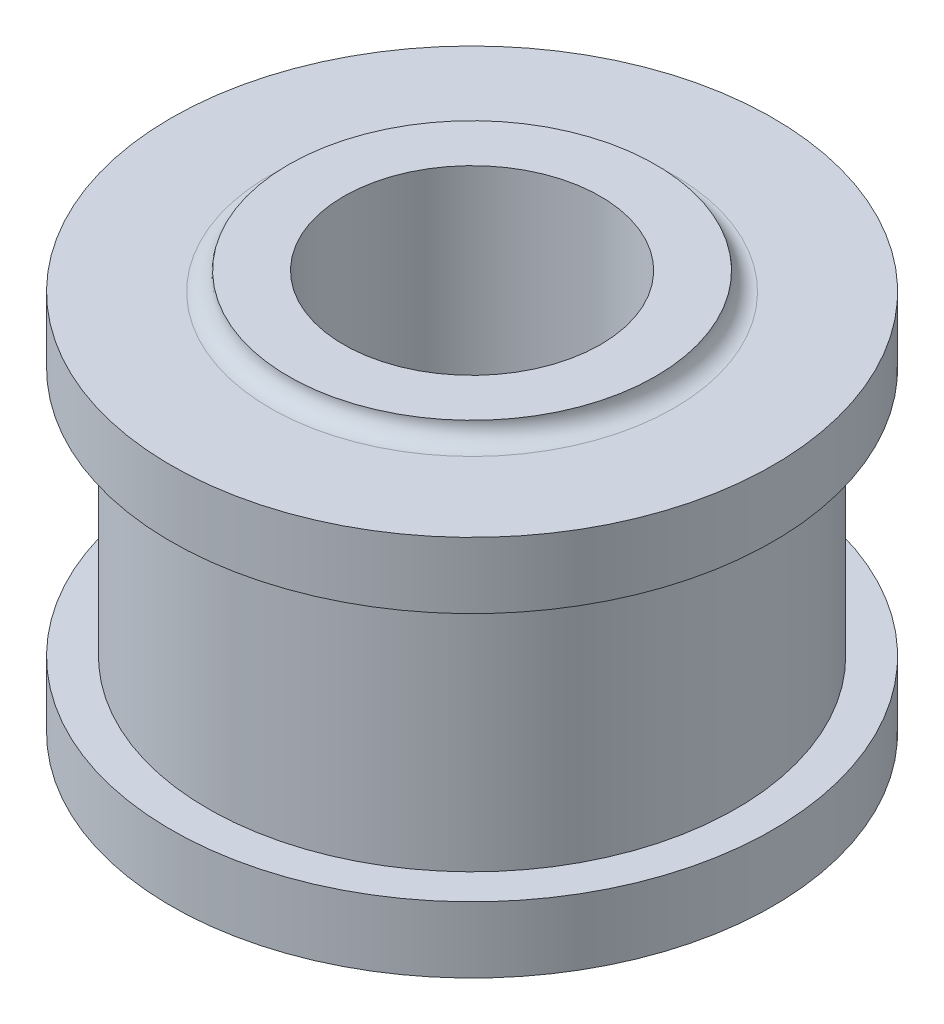
ISO-10303-21;
HEADER;
FILE_DESCRIPTION(('STEP AP214'),'2;1');
FILE_NAME('part.step','',(''),(''),'','','');
FILE_SCHEMA(('AUTOMOTIVE_DESIGN { 1 0 10303 214 1 1 1 1 }'));
ENDSEC;
DATA;
#1=APPLICATION_CONTEXT('core data for automotive mechanical design processes');
#2=APPLICATION_PROTOCOL_DEFINITION('international standard','automotive_design',2000,#1);
#3=PRODUCT_CONTEXT('',#1,'mechanical');
#4=PRODUCT('Part','Part','',(#3));
#5=PRODUCT_RELATED_PRODUCT_CATEGORY('part','',(#4));
#6=PRODUCT_DEFINITION_FORMATION('','',#4);
#7=PRODUCT_DEFINITION_CONTEXT('part definition',#1,'design');
#8=PRODUCT_DEFINITION('design','',#6,#7);
#9=PRODUCT_DEFINITION_SHAPE('','',#8);
#10=(LENGTH_UNIT() NAMED_UNIT(*) SI_UNIT(.MILLI.,.METRE.));
#11=(NAMED_UNIT(*) PLANE_ANGLE_UNIT() SI_UNIT($,.RADIAN.));
#12=(NAMED_UNIT(*) SI_UNIT($,.STERADIAN.) SOLID_ANGLE_UNIT());
#13=UNCERTAINTY_MEASURE_WITH_UNIT(LENGTH_MEASURE(1.E-05),#10,'distance_accuracy_value','');
#14=(GEOMETRIC_REPRESENTATION_CONTEXT(3) GLOBAL_UNCERTAINTY_ASSIGNED_CONTEXT((#13)) GLOBAL_UNIT_ASSIGNED_CONTEXT((#10,
#11,#12)) REPRESENTATION_CONTEXT('',''));
#15=CARTESIAN_POINT('',(0.,0.,0.));
#16=DIRECTION('',(0.,0.,1.));
#17=DIRECTION('',(1.,0.,0.));
#18=AXIS2_PLACEMENT_3D('',#15,#16,#17);
#19=CARTESIAN_POINT('',(0.,0.,0.));
#20=DIRECTION('',(0.,1.,0.));
#21=DIRECTION('',(-1.,0.,0.));
#22=AXIS2_PLACEMENT_3D('',#19,#20,#21);
#23=PLANE('',#22);
#24=CARTESIAN_POINT('',(0.,0.,0.));
#25=DIRECTION('',(0.,1.,0.));
#26=DIRECTION('',(-1.,0.,0.));
#27=AXIS2_PLACEMENT_3D('',#24,#25,#26);
#28=CIRCLE('',#27,17.5);
#29=CARTESIAN_POINT('',(-17.5,0.,0.));
#30=VERTEX_POINT('',#29);
#31=EDGE_CURVE('E71',#30,#30,#28,.F.);
#32=ORIENTED_EDGE('',*,*,#31,.F.);
#33=EDGE_LOOP('',(#32));
#34=FACE_BOUND('',#33,.T.);
#35=CARTESIAN_POINT('',(0.,0.,0.));
#36=DIRECTION('',(0.,1.,0.));
#37=DIRECTION('',(-1.,0.,0.));
#38=AXIS2_PLACEMENT_3D('',#35,#36,#37);
#39=CIRCLE('',#38,25.);
#40=CARTESIAN_POINT('',(-25.,0.,0.));
#41=VERTEX_POINT('',#40);
#42=EDGE_CURVE('E44',#41,#41,#39,.T.);
#43=ORIENTED_EDGE('',*,*,#42,.F.);
#44=EDGE_LOOP('',(#43));
#45=FACE_BOUND('',#44,.T.);
#46=ADVANCED_FACE('F33',(#34,#45),#23,.F.);
#47=CARTESIAN_POINT('',(25.,2.49999999999998,0.));
#48=DIRECTION('',(0.,1.,0.));
#49=DIRECTION('',(-1.,0.,0.));
#50=AXIS2_PLACEMENT_3D('',#47,#48,#49);
#51=PLANE('',#50);
#52=CARTESIAN_POINT('',(0.,2.49999999999998,0.));
#53=DIRECTION('',(0.,1.,0.));
#54=DIRECTION('',(-1.,0.,0.));
#55=AXIS2_PLACEMENT_3D('',#52,#53,#54);
#56=CIRCLE('',#55,27.5);
#57=CARTESIAN_POINT('',(-27.5,2.49999999999997,0.));
#58=VERTEX_POINT('',#57);
#59=EDGE_CURVE('E40',#58,#58,#56,.T.);
#60=ORIENTED_EDGE('',*,*,#59,.T.);
#61=EDGE_LOOP('',(#60));
#62=FACE_BOUND('',#61,.T.);
#63=CARTESIAN_POINT('',(0.,2.49999999999998,0.));
#64=DIRECTION('',(0.,1.,0.));
#65=DIRECTION('',(-1.,0.,0.));
#66=AXIS2_PLACEMENT_3D('',#63,#64,#65);
#67=CIRCLE('',#66,41.);
#68=CARTESIAN_POINT('',(-41.,2.49999999999997,0.));
#69=VERTEX_POINT('',#68);
#70=EDGE_CURVE('E48',#69,#69,#67,.T.);
#71=ORIENTED_EDGE('',*,*,#70,.F.);
#72=EDGE_LOOP('',(#71));
#73=FACE_BOUND('',#72,.T.);
#74=ADVANCED_FACE('F96',(#62,#73),#51,.F.);
#75=CARTESIAN_POINT('',(0.,60.7377049180328,0.));
#76=DIRECTION('',(0.,1.,0.));
#77=DIRECTION('',(-1.,0.,0.));
#78=AXIS2_PLACEMENT_3D('',#75,#76,#77);
#79=CYLINDRICAL_SURFACE('',#78,41.);
#80=CARTESIAN_POINT('',(0.,11.5,0.));
#81=DIRECTION('',(0.,1.,0.));
#82=DIRECTION('',(-1.,0.,0.));
#83=AXIS2_PLACEMENT_3D('',#80,#81,#82);
#84=CIRCLE('',#83,41.);
#85=CARTESIAN_POINT('',(-41.,11.5,0.));
#86=VERTEX_POINT('',#85);
#87=EDGE_CURVE('E53',#86,#86,#84,.T.);
#88=ORIENTED_EDGE('',*,*,#87,.F.);
#89=EDGE_LOOP('',(#88));
#90=FACE_BOUND('',#89,.T.);
#91=ORIENTED_EDGE('',*,*,#70,.T.);
#92=EDGE_LOOP('',(#91));
#93=FACE_BOUND('',#92,.T.);
#94=ADVANCED_FACE('F102',(#90,#93),#79,.T.);
#95=CARTESIAN_POINT('',(41.,11.5,0.));
#96=DIRECTION('',(0.,-1.,0.));
#97=DIRECTION('',(1.,0.,0.));
#98=AXIS2_PLACEMENT_3D('',#95,#96,#97);
#99=PLANE('',#98);
#100=CARTESIAN_POINT('',(0.,11.5,0.));
#101=DIRECTION('',(0.,1.,0.));
#102=DIRECTION('',(-1.,0.,0.));
#103=AXIS2_PLACEMENT_3D('',#100,#101,#102);
#104=CIRCLE('',#103,36.);
#105=CARTESIAN_POINT('',(-36.,11.5,0.));
#106=VERTEX_POINT('',#105);
#107=EDGE_CURVE('E56',#106,#106,#104,.T.);
#108=ORIENTED_EDGE('',*,*,#107,.F.);
#109=EDGE_LOOP('',(#108));
#110=FACE_BOUND('',#109,.T.);
#111=ORIENTED_EDGE('',*,*,#87,.T.);
#112=EDGE_LOOP('',(#111));
#113=FACE_BOUND('',#112,.T.);
#114=ADVANCED_FACE('F109',(#110,#113),#99,.F.);
#115=CARTESIAN_POINT('',(0.,60.7377049180328,0.));
#116=DIRECTION('',(0.,1.,0.));
#117=DIRECTION('',(-1.,0.,0.));
#118=AXIS2_PLACEMENT_3D('',#115,#116,#117);
#119=CYLINDRICAL_SURFACE('',#118,36.);
#120=CARTESIAN_POINT('',(0.,45.5,0.));
#121=DIRECTION('',(0.,1.,0.));
#122=DIRECTION('',(-1.,0.,0.));
#123=AXIS2_PLACEMENT_3D('',#120,#121,#122);
#124=CIRCLE('',#123,36.);
#125=CARTESIAN_POINT('',(-36.,45.5,0.));
#126=VERTEX_POINT('',#125);
#127=EDGE_CURVE('E59',#126,#126,#124,.T.);
#128=ORIENTED_EDGE('',*,*,#127,.F.);
#129=EDGE_LOOP('',(#128));
#130=FACE_BOUND('',#129,.T.);
#131=ORIENTED_EDGE('',*,*,#107,.T.);
#132=EDGE_LOOP('',(#131));
#133=FACE_BOUND('',#132,.T.);
#134=ADVANCED_FACE('F113',(#130,#133),#119,.T.);
#135=CARTESIAN_POINT('',(36.,45.5,0.));
#136=DIRECTION('',(0.,1.,0.));
#137=DIRECTION('',(-1.,0.,0.));
#138=AXIS2_PLACEMENT_3D('',#135,#136,#137);
#139=PLANE('',#138);
#140=CARTESIAN_POINT('',(0.,45.5,0.));
#141=DIRECTION('',(0.,1.,0.));
#142=DIRECTION('',(-1.,0.,0.));
#143=AXIS2_PLACEMENT_3D('',#140,#141,#142);
#144=CIRCLE('',#143,41.);
#145=CARTESIAN_POINT('',(-41.,45.5,0.));
#146=VERTEX_POINT('',#145);
#147=EDGE_CURVE('E62',#146,#146,#144,.T.);
#148=ORIENTED_EDGE('',*,*,#147,.F.);
#149=EDGE_LOOP('',(#148));
#150=FACE_BOUND('',#149,.T.);
#151=ORIENTED_EDGE('',*,*,#127,.T.);
#152=EDGE_LOOP('',(#151));
#153=FACE_BOUND('',#152,.T.);
#154=ADVANCED_FACE('F117',(#150,#153),#139,.F.);
#155=CARTESIAN_POINT('',(0.,60.7377049180328,0.));
#156=DIRECTION('',(0.,1.,0.));
#157=DIRECTION('',(-1.,0.,0.));
#158=AXIS2_PLACEMENT_3D('',#155,#156,#157);
#159=CYLINDRICAL_SURFACE('',#158,41.);
#160=CARTESIAN_POINT('',(0.,54.5,0.));
#161=DIRECTION('',(0.,1.,0.));
#162=DIRECTION('',(-1.,0.,0.));
#163=AXIS2_PLACEMENT_3D('',#160,#161,#162);
#164=CIRCLE('',#163,41.);
#165=CARTESIAN_POINT('',(-41.,54.5,0.));
#166=VERTEX_POINT('',#165);
#167=EDGE_CURVE('E65',#166,#166,#164,.T.);
#168=ORIENTED_EDGE('',*,*,#167,.F.);
#169=EDGE_LOOP('',(#168));
#170=FACE_BOUND('',#169,.T.);
#171=ORIENTED_EDGE('',*,*,#147,.T.);
#172=EDGE_LOOP('',(#171));
#173=FACE_BOUND('',#172,.T.);
#174=ADVANCED_FACE('F121',(#170,#173),#159,.T.);
#175=CARTESIAN_POINT('',(41.,54.5,0.));
#176=DIRECTION('',(0.,-1.,0.));
#177=DIRECTION('',(1.,0.,0.));
#178=AXIS2_PLACEMENT_3D('',#175,#176,#177);
#179=PLANE('',#178);
#180=CARTESIAN_POINT('',(0.,54.5,0.));
#181=DIRECTION('',(0.,-1.,0.));
#182=DIRECTION('',(1.,0.,0.));
#183=AXIS2_PLACEMENT_3D('',#180,#181,#182);
#184=CIRCLE('',#183,27.5);
#185=CARTESIAN_POINT('',(27.5,54.5,0.));
#186=VERTEX_POINT('',#185);
#187=EDGE_CURVE('E10',#186,#186,#184,.T.);
#188=ORIENTED_EDGE('',*,*,#187,.T.);
#189=EDGE_LOOP('',(#188));
#190=FACE_BOUND('',#189,.T.);
#191=ORIENTED_EDGE('',*,*,#167,.T.);
#192=EDGE_LOOP('',(#191));
#193=FACE_BOUND('',#192,.T.);
#194=ADVANCED_FACE('F84',(#190,#193),#179,.F.);
#195=CARTESIAN_POINT('',(25.,57.,0.));
#196=DIRECTION('',(0.,-1.,0.));
#197=DIRECTION('',(1.,0.,0.));
#198=AXIS2_PLACEMENT_3D('',#195,#196,#197);
#199=PLANE('',#198);
#200=CARTESIAN_POINT('',(0.,57.,0.));
#201=DIRECTION('',(0.,1.,0.));
#202=DIRECTION('',(-1.,0.,0.));
#203=AXIS2_PLACEMENT_3D('',#200,#201,#202);
#204=CIRCLE('',#203,17.5);
#205=CARTESIAN_POINT('',(-17.5,57.,0.));
#206=VERTEX_POINT('',#205);
#207=EDGE_CURVE('E74',#206,#206,#204,.T.);
#208=ORIENTED_EDGE('',*,*,#207,.F.);
#209=EDGE_LOOP('',(#208));
#210=FACE_BOUND('',#209,.T.);
#211=CARTESIAN_POINT('',(0.,57.,0.));
#212=DIRECTION('',(0.,1.,0.));
#213=DIRECTION('',(-1.,0.,0.));
#214=AXIS2_PLACEMENT_3D('',#211,#212,#213);
#215=CIRCLE('',#214,25.);
#216=CARTESIAN_POINT('',(-25.,57.,0.));
#217=VERTEX_POINT('',#216);
#218=EDGE_CURVE('E68',#217,#217,#215,.T.);
#219=ORIENTED_EDGE('',*,*,#218,.T.);
#220=EDGE_LOOP('',(#219));
#221=FACE_BOUND('',#220,.T.);
#222=ADVANCED_FACE('F81',(#210,#221),#199,.F.);
#223=CARTESIAN_POINT('',(0.,-0.00100000000002876,0.));
#224=DIRECTION('',(0.,1.,0.));
#225=DIRECTION('',(-1.,0.,0.));
#226=AXIS2_PLACEMENT_3D('',#223,#224,#225);
#227=CYLINDRICAL_SURFACE('',#226,17.5);
#228=CARTESIAN_POINT('',(-17.5,57.,0.));
#229=CARTESIAN_POINT('',(-17.5,56.40625,0.));
#230=CARTESIAN_POINT('',(-17.5,55.8125,0.));
#231=CARTESIAN_POINT('',(-17.5,54.625,0.));
#232=CARTESIAN_POINT('',(-17.5,54.03125,0.));
#233=CARTESIAN_POINT('',(-17.5,52.84375,0.));
#234=CARTESIAN_POINT('',(-17.5,52.25,0.));
#235=CARTESIAN_POINT('',(-17.5,51.0625,0.));
#236=CARTESIAN_POINT('',(-17.5,50.46875,0.));
#237=CARTESIAN_POINT('',(-17.5,49.28125,0.));
#238=CARTESIAN_POINT('',(-17.5,48.6875,0.));
#239=CARTESIAN_POINT('',(-17.5,47.5,0.));
#240=CARTESIAN_POINT('',(-17.5,46.90625,0.));
#241=CARTESIAN_POINT('',(-17.5,45.71875,0.));
#242=CARTESIAN_POINT('',(-17.5,45.125,0.));
#243=CARTESIAN_POINT('',(-17.5,43.9375,0.));
#244=CARTESIAN_POINT('',(-17.5,43.34375,0.));
#245=CARTESIAN_POINT('',(-17.5,42.15625,0.));
#246=CARTESIAN_POINT('',(-17.5,41.5625,0.));
#247=CARTESIAN_POINT('',(-17.5,40.375,0.));
#248=CARTESIAN_POINT('',(-17.5,39.78125,0.));
#249=CARTESIAN_POINT('',(-17.5,38.59375,0.));
#250=CARTESIAN_POINT('',(-17.5,38.,0.));
#251=CARTESIAN_POINT('',(-17.5,36.8125,0.));
#252=CARTESIAN_POINT('',(-17.5,36.21875,0.));
#253=CARTESIAN_POINT('',(-17.5,35.03125,0.));
#254=CARTESIAN_POINT('',(-17.5,34.4375,0.));
#255=CARTESIAN_POINT('',(-17.5,33.25,0.));
#256=CARTESIAN_POINT('',(-17.5,32.65625,0.));
#257=CARTESIAN_POINT('',(-17.5,31.46875,0.));
#258=CARTESIAN_POINT('',(-17.5,30.875,0.));
#259=CARTESIAN_POINT('',(-17.5,29.6875,0.));
#260=CARTESIAN_POINT('',(-17.5,29.09375,0.));
#261=CARTESIAN_POINT('',(-17.5,27.90625,0.));
#262=CARTESIAN_POINT('',(-17.5,27.3125,0.));
#263=CARTESIAN_POINT('',(-17.5,26.125,0.));
#264=CARTESIAN_POINT('',(-17.5,25.53125,0.));
#265=CARTESIAN_POINT('',(-17.5,24.34375,0.));
#266=CARTESIAN_POINT('',(-17.5,23.75,0.));
#267=CARTESIAN_POINT('',(-17.5,22.5625,0.));
#268=CARTESIAN_POINT('',(-17.5,21.96875,0.));
#269=CARTESIAN_POINT('',(-17.5,20.78125,0.));
#270=CARTESIAN_POINT('',(-17.5,20.1875,0.));
#271=CARTESIAN_POINT('',(-17.5,19.,0.));
#272=CARTESIAN_POINT('',(-17.5,18.40625,0.));
#273=CARTESIAN_POINT('',(-17.5,17.21875,0.));
#274=CARTESIAN_POINT('',(-17.5,16.625,0.));
#275=CARTESIAN_POINT('',(-17.5,15.4375,0.));
#276=CARTESIAN_POINT('',(-17.5,14.84375,0.));
#277=CARTESIAN_POINT('',(-17.5,13.65625,0.));
#278=CARTESIAN_POINT('',(-17.5,13.0625,0.));
#279=CARTESIAN_POINT('',(-17.5,11.875,0.));
#280=CARTESIAN_POINT('',(-17.5,11.28125,0.));
#281=CARTESIAN_POINT('',(-17.5,10.09375,0.));
#282=CARTESIAN_POINT('',(-17.5,9.5,0.));
#283=CARTESIAN_POINT('',(-17.5,8.3125,0.));
#284=CARTESIAN_POINT('',(-17.5,7.71875,0.));
#285=CARTESIAN_POINT('',(-17.5,6.53125,0.));
#286=CARTESIAN_POINT('',(-17.5,5.9375,0.));
#287=CARTESIAN_POINT('',(-17.5,4.75,0.));
#288=CARTESIAN_POINT('',(-17.5,4.15625,0.));
#289=CARTESIAN_POINT('',(-17.5,2.96875,0.));
#290=CARTESIAN_POINT('',(-17.5,2.375,0.));
#291=CARTESIAN_POINT('',(-17.5,1.1875,0.));
#292=CARTESIAN_POINT('',(-17.5,0.593750000000002,0.));
#293=CARTESIAN_POINT('',(-17.5,0.,0.));
#294=B_SPLINE_CURVE_WITH_KNOTS('',3,(#228,#229,#230,#231,#232,#233,#234,#235,#236,#237,#238,
#239,#240,#241,#242,#243,#244,#245,#246,#247,#248,#249,#250,#251,#252,#253,#254,#255,#256,#257,
#258,#259,#260,#261,#262,#263,#264,#265,#266,#267,#268,#269,#270,#271,#272,#273,#274,#275,#276,
#277,#278,#279,#280,#281,#282,#283,#284,#285,#286,#287,#288,#289,#290,#291,#292,#293),
.UNSPECIFIED.,.F.,.F.,(4,2,2,2,2,2,2,2,2,2,2,2,2,2,2,2,2,2,2,2,2,2,2,2,2,2,2,2,2,2,2,2,4),(0.,
1.78125,3.5625,5.34375,7.125,8.90625,10.6875,12.46875,14.25,16.03125,17.8125,19.59375,21.375,
23.15625,24.9375,26.71875,28.5,30.28125,32.0625,33.84375,35.625,37.40625,39.1875,40.96875,42.75,
44.53125,46.3125,48.09375,49.875,51.65625,53.4375,55.21875,57.),.UNSPECIFIED.);
#295=EDGE_CURVE('BSEAM78',#206,#30,#294,.T.);
#296=ORIENTED_EDGE('',*,*,#207,.T.);
#297=ORIENTED_EDGE('',*,*,#31,.T.);
#298=ORIENTED_EDGE('',*,*,#295,.T.);
#299=ORIENTED_EDGE('',*,*,#295,.F.);
#300=EDGE_LOOP('',(#296,#298,#297,#299));
#301=FACE_BOUND('',#300,.T.);
#302=ADVANCED_FACE('F78',(#301),#227,.F.);
#303=CARTESIAN_POINT('',(0.,0.,0.));
#304=DIRECTION('',(0.,1.,0.));
#305=DIRECTION('',(-1.,0.,0.));
#306=AXIS2_PLACEMENT_3D('',#303,#304,#305);
#307=TOROIDAL_SURFACE('',#306,27.5,2.5);
#308=ORIENTED_EDGE('',*,*,#42,.T.);
#309=EDGE_LOOP('',(#308));
#310=FACE_BOUND('',#309,.T.);
#311=ORIENTED_EDGE('',*,*,#59,.F.);
#312=EDGE_LOOP('',(#311));
#313=FACE_BOUND('',#312,.T.);
#314=ADVANCED_FACE('F89',(#310,#313),#307,.F.);
#315=CARTESIAN_POINT('',(0.,57.,0.));
#316=DIRECTION('',(0.,-1.,0.));
#317=DIRECTION('',(1.,0.,0.));
#318=AXIS2_PLACEMENT_3D('',#315,#316,#317);
#319=TOROIDAL_SURFACE('',#318,27.5,2.5);
#320=ORIENTED_EDGE('',*,*,#187,.F.);
#321=EDGE_LOOP('',(#320));
#322=FACE_BOUND('',#321,.T.);
#323=ORIENTED_EDGE('',*,*,#218,.F.);
#324=EDGE_LOOP('',(#323));
#325=FACE_BOUND('',#324,.T.);
#326=ADVANCED_FACE('F35',(#322,#325),#319,.F.);
#327=CLOSED_SHELL('',(#46,#74,#94,#114,#134,#154,#174,#194,#222,#302,#314,#326));
#328=MANIFOLD_SOLID_BREP('B2',#327);
#329=ADVANCED_BREP_SHAPE_REPRESENTATION('',(#18,#328),#14);
#330=SHAPE_DEFINITION_REPRESENTATION(#9,#329);
ENDSEC;
END-ISO-10303-21;
